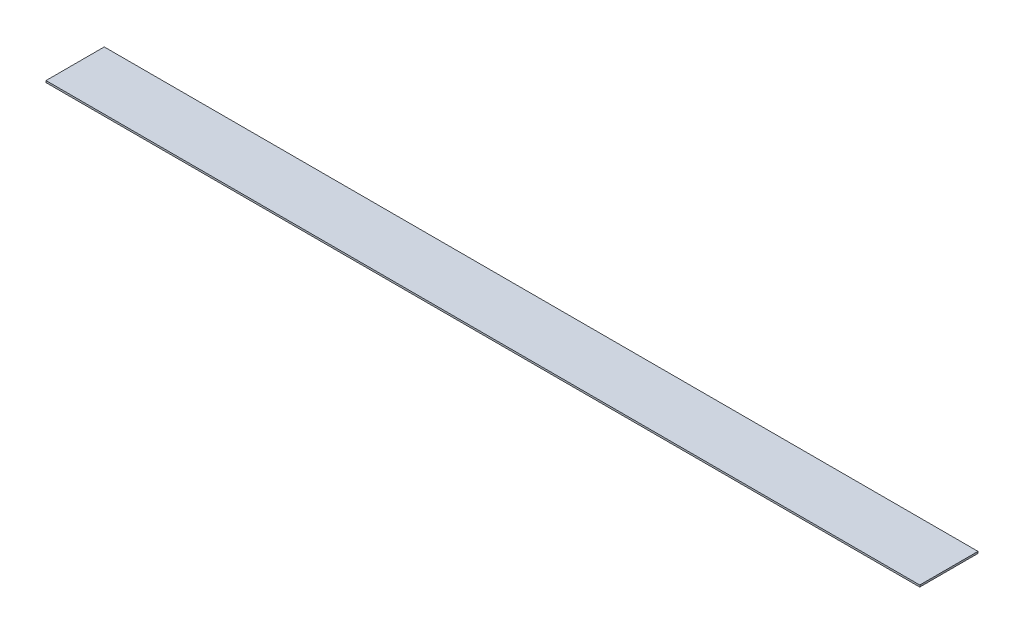
ISO-10303-21;
HEADER;
FILE_DESCRIPTION(('STEP AP214'),'2;1');
FILE_NAME('part.step','',(''),(''),'','','');
FILE_SCHEMA(('AUTOMOTIVE_DESIGN { 1 0 10303 214 1 1 1 1 }'));
ENDSEC;
DATA;
#1=APPLICATION_CONTEXT('core data for automotive mechanical design processes');
#2=APPLICATION_PROTOCOL_DEFINITION('international standard','automotive_design',2000,#1);
#3=PRODUCT_CONTEXT('',#1,'mechanical');
#4=PRODUCT('Part','Part','',(#3));
#5=PRODUCT_RELATED_PRODUCT_CATEGORY('part','',(#4));
#6=PRODUCT_DEFINITION_FORMATION('','',#4);
#7=PRODUCT_DEFINITION_CONTEXT('part definition',#1,'design');
#8=PRODUCT_DEFINITION('design','',#6,#7);
#9=PRODUCT_DEFINITION_SHAPE('','',#8);
#10=(LENGTH_UNIT() NAMED_UNIT(*) SI_UNIT(.MILLI.,.METRE.));
#11=(NAMED_UNIT(*) PLANE_ANGLE_UNIT() SI_UNIT($,.RADIAN.));
#12=(NAMED_UNIT(*) SI_UNIT($,.STERADIAN.) SOLID_ANGLE_UNIT());
#13=UNCERTAINTY_MEASURE_WITH_UNIT(LENGTH_MEASURE(1.E-05),#10,'distance_accuracy_value','');
#14=(GEOMETRIC_REPRESENTATION_CONTEXT(3) GLOBAL_UNCERTAINTY_ASSIGNED_CONTEXT((#13)) GLOBAL_UNIT_ASSIGNED_CONTEXT((#10,
#11,#12)) REPRESENTATION_CONTEXT('',''));
#15=CARTESIAN_POINT('',(0.,0.,0.));
#16=DIRECTION('',(0.,0.,1.));
#17=DIRECTION('',(1.,0.,0.));
#18=AXIS2_PLACEMENT_3D('',#15,#16,#17);
#19=CARTESIAN_POINT('',(0.,1.5875,0.));
#20=DIRECTION('',(1.,0.,0.));
#21=DIRECTION('',(0.,0.,-1.));
#22=AXIS2_PLACEMENT_3D('',#19,#20,#21);
#23=PLANE('',#22);
#24=DIRECTION('',(0.,0.,1.));
#25=VECTOR('',#24,1.);
#26=CARTESIAN_POINT('',(0.,0.,0.));
#27=LINE('',#26,#25);
#28=CARTESIAN_POINT('',(0.,0.,-50.8));
#29=VERTEX_POINT('',#28);
#30=CARTESIAN_POINT('',(0.,0.,0.));
#31=VERTEX_POINT('',#30);
#32=EDGE_CURVE('E95',#29,#31,#27,.T.);
#33=ORIENTED_EDGE('',*,*,#32,.T.);
#34=DIRECTION('',(0.,-1.,0.));
#35=VECTOR('',#34,1.);
#36=CARTESIAN_POINT('',(0.,1.5875,0.));
#37=LINE('',#36,#35);
#38=CARTESIAN_POINT('',(0.,1.5875,0.));
#39=VERTEX_POINT('',#38);
#40=EDGE_CURVE('E11',#39,#31,#37,.T.);
#41=ORIENTED_EDGE('',*,*,#40,.F.);
#42=DIRECTION('',(0.,0.,1.));
#43=VECTOR('',#42,1.);
#44=CARTESIAN_POINT('',(0.,1.5875,0.));
#45=LINE('',#44,#43);
#46=CARTESIAN_POINT('',(0.,1.5875,-50.8));
#47=VERTEX_POINT('',#46);
#48=EDGE_CURVE('E83',#47,#39,#45,.T.);
#49=ORIENTED_EDGE('',*,*,#48,.F.);
#50=DIRECTION('',(0.,-1.,0.));
#51=VECTOR('',#50,1.);
#52=CARTESIAN_POINT('',(0.,1.5875,-50.8));
#53=LINE('',#52,#51);
#54=EDGE_CURVE('E91',#47,#29,#53,.T.);
#55=ORIENTED_EDGE('',*,*,#54,.T.);
#56=EDGE_LOOP('',(#33,#41,#49,#55));
#57=FACE_BOUND('',#56,.T.);
#58=ADVANCED_FACE('F32',(#57),#23,.F.);
#59=CARTESIAN_POINT('',(0.,1.5875,0.));
#60=DIRECTION('',(0.,0.,-1.));
#61=DIRECTION('',(-1.,0.,0.));
#62=AXIS2_PLACEMENT_3D('',#59,#60,#61);
#63=PLANE('',#62);
#64=DIRECTION('',(1.,0.,0.));
#65=VECTOR('',#64,1.);
#66=CARTESIAN_POINT('',(0.,0.,0.));
#67=LINE('',#66,#65);
#68=CARTESIAN_POINT('',(762.,0.,0.));
#69=VERTEX_POINT('',#68);
#70=EDGE_CURVE('E87',#31,#69,#67,.T.);
#71=ORIENTED_EDGE('',*,*,#70,.T.);
#72=DIRECTION('',(0.,-1.,0.));
#73=VECTOR('',#72,1.);
#74=CARTESIAN_POINT('',(762.,1.5875,0.));
#75=LINE('',#74,#73);
#76=CARTESIAN_POINT('',(762.,1.5875,0.));
#77=VERTEX_POINT('',#76);
#78=EDGE_CURVE('E40',#77,#69,#75,.T.);
#79=ORIENTED_EDGE('',*,*,#78,.F.);
#80=DIRECTION('',(1.,0.,0.));
#81=VECTOR('',#80,1.);
#82=CARTESIAN_POINT('',(0.,1.5875,0.));
#83=LINE('',#82,#81);
#84=EDGE_CURVE('E78',#39,#77,#83,.T.);
#85=ORIENTED_EDGE('',*,*,#84,.F.);
#86=ORIENTED_EDGE('',*,*,#40,.T.);
#87=EDGE_LOOP('',(#71,#79,#85,#86));
#88=FACE_BOUND('',#87,.T.);
#89=ADVANCED_FACE('F86',(#88),#63,.F.);
#90=CARTESIAN_POINT('',(762.,1.5875,0.));
#91=DIRECTION('',(-1.,0.,0.));
#92=DIRECTION('',(0.,0.,1.));
#93=AXIS2_PLACEMENT_3D('',#90,#91,#92);
#94=PLANE('',#93);
#95=DIRECTION('',(0.,0.,-1.));
#96=VECTOR('',#95,1.);
#97=CARTESIAN_POINT('',(762.,0.,0.));
#98=LINE('',#97,#96);
#99=CARTESIAN_POINT('',(762.,0.,-50.8));
#100=VERTEX_POINT('',#99);
#101=EDGE_CURVE('E65',#69,#100,#98,.T.);
#102=ORIENTED_EDGE('',*,*,#101,.T.);
#103=DIRECTION('',(0.,-1.,0.));
#104=VECTOR('',#103,1.);
#105=CARTESIAN_POINT('',(762.,1.5875,-50.8));
#106=LINE('',#105,#104);
#107=CARTESIAN_POINT('',(762.,1.5875,-50.8));
#108=VERTEX_POINT('',#107);
#109=EDGE_CURVE('E88',#108,#100,#106,.T.);
#110=ORIENTED_EDGE('',*,*,#109,.F.);
#111=DIRECTION('',(0.,0.,-1.));
#112=VECTOR('',#111,1.);
#113=CARTESIAN_POINT('',(762.,1.5875,0.));
#114=LINE('',#113,#112);
#115=EDGE_CURVE('E81',#77,#108,#114,.T.);
#116=ORIENTED_EDGE('',*,*,#115,.F.);
#117=ORIENTED_EDGE('',*,*,#78,.T.);
#118=EDGE_LOOP('',(#102,#110,#116,#117));
#119=FACE_BOUND('',#118,.T.);
#120=ADVANCED_FACE('F89',(#119),#94,.F.);
#121=CARTESIAN_POINT('',(0.,1.5875,-50.8));
#122=DIRECTION('',(0.,0.,1.));
#123=DIRECTION('',(1.,0.,0.));
#124=AXIS2_PLACEMENT_3D('',#121,#122,#123);
#125=PLANE('',#124);
#126=DIRECTION('',(-1.,0.,0.));
#127=VECTOR('',#126,1.);
#128=CARTESIAN_POINT('',(0.,0.,-50.8));
#129=LINE('',#128,#127);
#130=EDGE_CURVE('E71',#100,#29,#129,.T.);
#131=ORIENTED_EDGE('',*,*,#130,.T.);
#132=ORIENTED_EDGE('',*,*,#54,.F.);
#133=DIRECTION('',(-1.,0.,0.));
#134=VECTOR('',#133,1.);
#135=CARTESIAN_POINT('',(0.,1.5875,-50.8));
#136=LINE('',#135,#134);
#137=EDGE_CURVE('E48',#108,#47,#136,.T.);
#138=ORIENTED_EDGE('',*,*,#137,.F.);
#139=ORIENTED_EDGE('',*,*,#109,.T.);
#140=EDGE_LOOP('',(#131,#132,#138,#139));
#141=FACE_BOUND('',#140,.T.);
#142=ADVANCED_FACE('F102',(#141),#125,.F.);
#143=CARTESIAN_POINT('',(0.,1.5875,0.));
#144=DIRECTION('',(0.,-1.,0.));
#145=DIRECTION('',(0.,0.,-1.));
#146=AXIS2_PLACEMENT_3D('',#143,#144,#145);
#147=PLANE('',#146);
#148=ORIENTED_EDGE('',*,*,#48,.T.);
#149=ORIENTED_EDGE('',*,*,#84,.T.);
#150=ORIENTED_EDGE('',*,*,#115,.T.);
#151=ORIENTED_EDGE('',*,*,#137,.T.);
#152=EDGE_LOOP('',(#148,#149,#150,#151));
#153=FACE_BOUND('',#152,.T.);
#154=ADVANCED_FACE('F79',(#153),#147,.F.);
#155=CARTESIAN_POINT('',(0.,0.,0.));
#156=DIRECTION('',(0.,-1.,0.));
#157=DIRECTION('',(0.,0.,-1.));
#158=AXIS2_PLACEMENT_3D('',#155,#156,#157);
#159=PLANE('',#158);
#160=ORIENTED_EDGE('',*,*,#32,.F.);
#161=ORIENTED_EDGE('',*,*,#130,.F.);
#162=ORIENTED_EDGE('',*,*,#101,.F.);
#163=ORIENTED_EDGE('',*,*,#70,.F.);
#164=EDGE_LOOP('',(#160,#161,#162,#163));
#165=FACE_BOUND('',#164,.T.);
#166=ADVANCED_FACE('F105',(#165),#159,.T.);
#167=CLOSED_SHELL('',(#58,#89,#120,#142,#154,#166));
#168=MANIFOLD_SOLID_BREP('B2',#167);
#169=ADVANCED_BREP_SHAPE_REPRESENTATION('',(#18,#168),#14);
#170=SHAPE_DEFINITION_REPRESENTATION(#9,#169);
ENDSEC;
END-ISO-10303-21;
